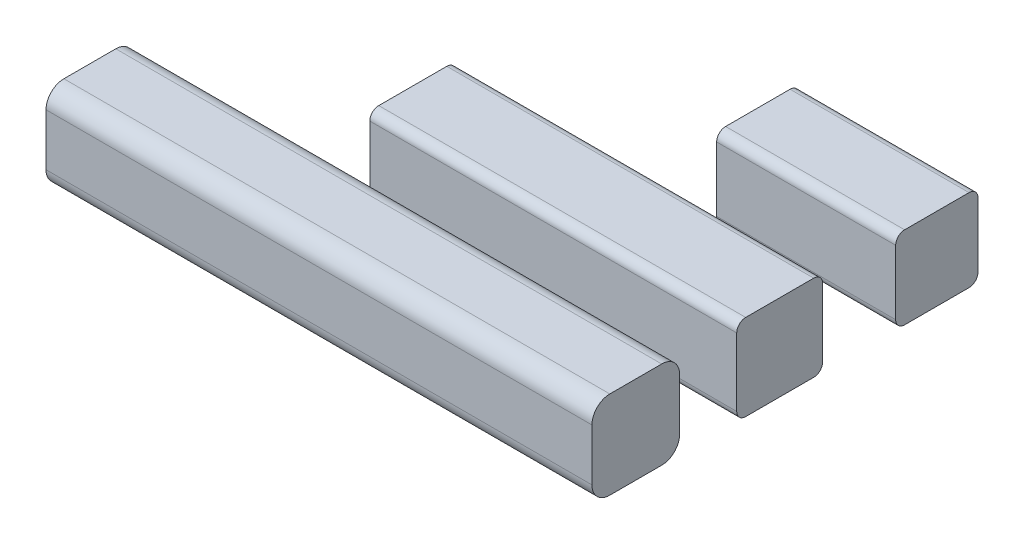
ISO-10303-21;
HEADER;
FILE_DESCRIPTION(('STEP AP214'),'2;1');
FILE_NAME('part.step','',(''),(''),'','','');
FILE_SCHEMA(('AUTOMOTIVE_DESIGN { 1 0 10303 214 1 1 1 1 }'));
ENDSEC;
DATA;
#1=APPLICATION_CONTEXT('core data for automotive mechanical design processes');
#2=APPLICATION_PROTOCOL_DEFINITION('international standard','automotive_design',2000,#1);
#3=PRODUCT_CONTEXT('',#1,'mechanical');
#4=PRODUCT('Part','Part','',(#3));
#5=PRODUCT_RELATED_PRODUCT_CATEGORY('part','',(#4));
#6=PRODUCT_DEFINITION_FORMATION('','',#4);
#7=PRODUCT_DEFINITION_CONTEXT('part definition',#1,'design');
#8=PRODUCT_DEFINITION('design','',#6,#7);
#9=PRODUCT_DEFINITION_SHAPE('','',#8);
#10=(LENGTH_UNIT() NAMED_UNIT(*) SI_UNIT(.MILLI.,.METRE.));
#11=(NAMED_UNIT(*) PLANE_ANGLE_UNIT() SI_UNIT($,.RADIAN.));
#12=(NAMED_UNIT(*) SI_UNIT($,.STERADIAN.) SOLID_ANGLE_UNIT());
#13=UNCERTAINTY_MEASURE_WITH_UNIT(LENGTH_MEASURE(1.E-05),#10,'distance_accuracy_value','');
#14=(GEOMETRIC_REPRESENTATION_CONTEXT(3) GLOBAL_UNCERTAINTY_ASSIGNED_CONTEXT((#13)) GLOBAL_UNIT_ASSIGNED_CONTEXT((#10,
#11,#12)) REPRESENTATION_CONTEXT('',''));
#15=CARTESIAN_POINT('',(0.,0.,0.));
#16=DIRECTION('',(0.,0.,1.));
#17=DIRECTION('',(1.,0.,0.));
#18=AXIS2_PLACEMENT_3D('',#15,#16,#17);
#19=CARTESIAN_POINT('',(10.,0.,-32.7247889230842));
#20=DIRECTION('',(0.,0.,-1.));
#21=DIRECTION('',(-1.,0.,0.));
#22=AXIS2_PLACEMENT_3D('',#19,#20,#21);
#23=PLANE('',#22);
#24=DIRECTION('',(-1.,0.,0.));
#25=VECTOR('',#24,1.);
#26=CARTESIAN_POINT('',(10.,4.3,-32.7247889230842));
#27=LINE('',#26,#25);
#28=CARTESIAN_POINT('',(10.,4.3,-32.7247889230842));
#29=VERTEX_POINT('',#28);
#30=CARTESIAN_POINT('',(-10.5,4.3,-32.7247889230842));
#31=VERTEX_POINT('',#30);
#32=EDGE_CURVE('E54',#29,#31,#27,.T.);
#33=ORIENTED_EDGE('',*,*,#32,.T.);
#34=DIRECTION('',(0.,1.,0.));
#35=VECTOR('',#34,1.);
#36=CARTESIAN_POINT('',(-10.5,0.5,-32.7247889230842));
#37=LINE('',#36,#35);
#38=CARTESIAN_POINT('',(-10.5,0.5,-32.7247889230842));
#39=VERTEX_POINT('',#38);
#40=EDGE_CURVE('E136',#39,#31,#37,.T.);
#41=ORIENTED_EDGE('',*,*,#40,.F.);
#42=DIRECTION('',(-1.,0.,0.));
#43=VECTOR('',#42,1.);
#44=CARTESIAN_POINT('',(10.,0.5,-32.7247889230842));
#45=LINE('',#44,#43);
#46=CARTESIAN_POINT('',(10.,0.5,-32.7247889230842));
#47=VERTEX_POINT('',#46);
#48=EDGE_CURVE('E12',#39,#47,#45,.F.);
#49=ORIENTED_EDGE('',*,*,#48,.T.);
#50=DIRECTION('',(0.,-1.,0.));
#51=VECTOR('',#50,1.);
#52=CARTESIAN_POINT('',(10.,0.,-32.7247889230842));
#53=LINE('',#52,#51);
#54=EDGE_CURVE('E152',#29,#47,#53,.T.);
#55=ORIENTED_EDGE('',*,*,#54,.F.);
#56=EDGE_LOOP('',(#33,#41,#49,#55));
#57=FACE_BOUND('',#56,.T.);
#58=ADVANCED_FACE('F46',(#57),#23,.F.);
#59=CARTESIAN_POINT('',(10.,0.,-32.7247889230842));
#60=DIRECTION('',(0.,1.,0.));
#61=DIRECTION('',(0.,0.,1.));
#62=AXIS2_PLACEMENT_3D('',#59,#60,#61);
#63=PLANE('',#62);
#64=DIRECTION('',(-1.,0.,0.));
#65=VECTOR('',#64,1.);
#66=CARTESIAN_POINT('',(10.,0.,-33.2247889230842));
#67=LINE('',#66,#65);
#68=CARTESIAN_POINT('',(10.,0.,-33.2247889230842));
#69=VERTEX_POINT('',#68);
#70=CARTESIAN_POINT('',(-10.5,0.,-33.2247889230842));
#71=VERTEX_POINT('',#70);
#72=EDGE_CURVE('E171',#69,#71,#67,.T.);
#73=ORIENTED_EDGE('',*,*,#72,.T.);
#74=DIRECTION('',(0.,0.,1.));
#75=VECTOR('',#74,1.);
#76=CARTESIAN_POINT('',(-10.5,0.,-37.0247889230842));
#77=LINE('',#76,#75);
#78=CARTESIAN_POINT('',(-10.5,0.,-37.0247889230842));
#79=VERTEX_POINT('',#78);
#80=EDGE_CURVE('E146',#79,#71,#77,.T.);
#81=ORIENTED_EDGE('',*,*,#80,.F.);
#82=DIRECTION('',(-1.,0.,0.));
#83=VECTOR('',#82,1.);
#84=CARTESIAN_POINT('',(10.,0.,-37.0247889230842));
#85=LINE('',#84,#83);
#86=CARTESIAN_POINT('',(10.,0.,-37.0247889230842));
#87=VERTEX_POINT('',#86);
#88=EDGE_CURVE('E61',#79,#87,#85,.F.);
#89=ORIENTED_EDGE('',*,*,#88,.T.);
#90=DIRECTION('',(0.,0.,-1.));
#91=VECTOR('',#90,1.);
#92=CARTESIAN_POINT('',(10.,0.,-32.7247889230842));
#93=LINE('',#92,#91);
#94=EDGE_CURVE('E154',#69,#87,#93,.T.);
#95=ORIENTED_EDGE('',*,*,#94,.F.);
#96=EDGE_LOOP('',(#73,#81,#89,#95));
#97=FACE_BOUND('',#96,.T.);
#98=ADVANCED_FACE('F180',(#97),#63,.F.);
#99=CARTESIAN_POINT('',(10.,0.,-37.5247889230842));
#100=DIRECTION('',(0.,0.,1.));
#101=DIRECTION('',(1.,0.,0.));
#102=AXIS2_PLACEMENT_3D('',#99,#100,#101);
#103=PLANE('',#102);
#104=DIRECTION('',(-1.,0.,0.));
#105=VECTOR('',#104,1.);
#106=CARTESIAN_POINT('',(10.,0.5,-37.5247889230842));
#107=LINE('',#106,#105);
#108=CARTESIAN_POINT('',(10.,0.5,-37.5247889230842));
#109=VERTEX_POINT('',#108);
#110=CARTESIAN_POINT('',(-10.5,0.5,-37.5247889230842));
#111=VERTEX_POINT('',#110);
#112=EDGE_CURVE('E161',#109,#111,#107,.T.);
#113=ORIENTED_EDGE('',*,*,#112,.T.);
#114=DIRECTION('',(0.,-1.,0.));
#115=VECTOR('',#114,1.);
#116=CARTESIAN_POINT('',(-10.5,4.3,-37.5247889230842));
#117=LINE('',#116,#115);
#118=CARTESIAN_POINT('',(-10.5,4.3,-37.5247889230842));
#119=VERTEX_POINT('',#118);
#120=EDGE_CURVE('E140',#119,#111,#117,.T.);
#121=ORIENTED_EDGE('',*,*,#120,.F.);
#122=DIRECTION('',(-1.,0.,0.));
#123=VECTOR('',#122,1.);
#124=CARTESIAN_POINT('',(10.,4.3,-37.5247889230842));
#125=LINE('',#124,#123);
#126=CARTESIAN_POINT('',(10.,4.3,-37.5247889230842));
#127=VERTEX_POINT('',#126);
#128=EDGE_CURVE('E163',#119,#127,#125,.F.);
#129=ORIENTED_EDGE('',*,*,#128,.T.);
#130=DIRECTION('',(0.,1.,0.));
#131=VECTOR('',#130,1.);
#132=CARTESIAN_POINT('',(10.,0.,-37.5247889230842));
#133=LINE('',#132,#131);
#134=EDGE_CURVE('E156',#109,#127,#133,.T.);
#135=ORIENTED_EDGE('',*,*,#134,.F.);
#136=EDGE_LOOP('',(#113,#121,#129,#135));
#137=FACE_BOUND('',#136,.T.);
#138=ADVANCED_FACE('F190',(#137),#103,.F.);
#139=CARTESIAN_POINT('',(10.,4.8,-32.7247889230842));
#140=DIRECTION('',(0.,-1.,0.));
#141=DIRECTION('',(0.,0.,-1.));
#142=AXIS2_PLACEMENT_3D('',#139,#140,#141);
#143=PLANE('',#142);
#144=DIRECTION('',(0.,0.,1.));
#145=VECTOR('',#144,1.);
#146=CARTESIAN_POINT('',(10.,4.8,-32.7247889230842));
#147=LINE('',#146,#145);
#148=CARTESIAN_POINT('',(10.,4.8,-37.0247889230842));
#149=VERTEX_POINT('',#148);
#150=CARTESIAN_POINT('',(10.,4.8,-33.2247889230842));
#151=VERTEX_POINT('',#150);
#152=EDGE_CURVE('E121',#149,#151,#147,.T.);
#153=ORIENTED_EDGE('',*,*,#152,.F.);
#154=DIRECTION('',(-1.,0.,0.));
#155=VECTOR('',#154,1.);
#156=CARTESIAN_POINT('',(10.,4.8,-37.0247889230842));
#157=LINE('',#156,#155);
#158=CARTESIAN_POINT('',(-10.5,4.8,-37.0247889230842));
#159=VERTEX_POINT('',#158);
#160=EDGE_CURVE('E120',#149,#159,#157,.T.);
#161=ORIENTED_EDGE('',*,*,#160,.T.);
#162=DIRECTION('',(0.,0.,-1.));
#163=VECTOR('',#162,1.);
#164=CARTESIAN_POINT('',(-10.5,4.8,-33.2247889230842));
#165=LINE('',#164,#163);
#166=CARTESIAN_POINT('',(-10.5,4.8,-33.2247889230842));
#167=VERTEX_POINT('',#166);
#168=EDGE_CURVE('E124',#167,#159,#165,.T.);
#169=ORIENTED_EDGE('',*,*,#168,.F.);
#170=DIRECTION('',(-1.,0.,0.));
#171=VECTOR('',#170,1.);
#172=CARTESIAN_POINT('',(10.,4.8,-33.2247889230842));
#173=LINE('',#172,#171);
#174=EDGE_CURVE('E111',#167,#151,#173,.F.);
#175=ORIENTED_EDGE('',*,*,#174,.T.);
#176=EDGE_LOOP('',(#153,#161,#169,#175));
#177=FACE_BOUND('',#176,.T.);
#178=ADVANCED_FACE('F125',(#177),#143,.F.);
#179=CARTESIAN_POINT('',(10.,0.,0.));
#180=DIRECTION('',(-1.,0.,0.));
#181=DIRECTION('',(0.,0.,1.));
#182=AXIS2_PLACEMENT_3D('',#179,#180,#181);
#183=PLANE('',#182);
#184=ORIENTED_EDGE('',*,*,#134,.T.);
#185=CARTESIAN_POINT('',(10.,4.3,-37.0247889230842));
#186=DIRECTION('',(-1.,0.,0.));
#187=DIRECTION('',(0.,0.,1.));
#188=AXIS2_PLACEMENT_3D('',#185,#186,#187);
#189=CIRCLE('',#188,0.5);
#190=EDGE_CURVE('E169',#127,#149,#189,.F.);
#191=ORIENTED_EDGE('',*,*,#190,.T.);
#192=ORIENTED_EDGE('',*,*,#152,.T.);
#193=CARTESIAN_POINT('',(10.,4.3,-33.2247889230842));
#194=DIRECTION('',(-1.,0.,0.));
#195=DIRECTION('',(0.,0.,1.));
#196=AXIS2_PLACEMENT_3D('',#193,#194,#195);
#197=CIRCLE('',#196,0.5);
#198=EDGE_CURVE('E116',#151,#29,#197,.F.);
#199=ORIENTED_EDGE('',*,*,#198,.T.);
#200=ORIENTED_EDGE('',*,*,#54,.T.);
#201=CARTESIAN_POINT('',(10.,0.5,-33.2247889230842));
#202=DIRECTION('',(-1.,0.,0.));
#203=DIRECTION('',(0.,0.,1.));
#204=AXIS2_PLACEMENT_3D('',#201,#202,#203);
#205=CIRCLE('',#204,0.5);
#206=EDGE_CURVE('E68',#47,#69,#205,.F.);
#207=ORIENTED_EDGE('',*,*,#206,.T.);
#208=ORIENTED_EDGE('',*,*,#94,.T.);
#209=CARTESIAN_POINT('',(10.,0.5,-37.0247889230842));
#210=DIRECTION('',(-1.,0.,0.));
#211=DIRECTION('',(0.,0.,1.));
#212=AXIS2_PLACEMENT_3D('',#209,#210,#211);
#213=CIRCLE('',#212,0.5);
#214=EDGE_CURVE('E167',#87,#109,#213,.F.);
#215=ORIENTED_EDGE('',*,*,#214,.T.);
#216=EDGE_LOOP('',(#184,#191,#192,#199,#200,#207,#208,#215));
#217=FACE_BOUND('',#216,.T.);
#218=ADVANCED_FACE('F175',(#217),#183,.F.);
#219=CARTESIAN_POINT('',(10.,4.3,-37.0247889230842));
#220=DIRECTION('',(-1.,0.,0.));
#221=DIRECTION('',(0.,0.,1.));
#222=AXIS2_PLACEMENT_3D('',#219,#220,#221);
#223=CYLINDRICAL_SURFACE('',#222,0.5);
#224=ORIENTED_EDGE('',*,*,#190,.F.);
#225=ORIENTED_EDGE('',*,*,#128,.F.);
#226=CARTESIAN_POINT('',(-10.5,4.3,-37.0247889230842));
#227=DIRECTION('',(-1.,0.,0.));
#228=DIRECTION('',(0.,0.,1.));
#229=AXIS2_PLACEMENT_3D('',#226,#227,#228);
#230=CIRCLE('',#229,0.5);
#231=EDGE_CURVE('E130',#159,#119,#230,.T.);
#232=ORIENTED_EDGE('',*,*,#231,.F.);
#233=ORIENTED_EDGE('',*,*,#160,.F.);
#234=EDGE_LOOP('',(#224,#225,#232,#233));
#235=FACE_BOUND('',#234,.T.);
#236=ADVANCED_FACE('F192',(#235),#223,.T.);
#237=CARTESIAN_POINT('',(10.,0.5,-37.0247889230842));
#238=DIRECTION('',(-1.,0.,0.));
#239=DIRECTION('',(0.,0.,1.));
#240=AXIS2_PLACEMENT_3D('',#237,#238,#239);
#241=CYLINDRICAL_SURFACE('',#240,0.5);
#242=ORIENTED_EDGE('',*,*,#214,.F.);
#243=ORIENTED_EDGE('',*,*,#88,.F.);
#244=CARTESIAN_POINT('',(-10.5,0.5,-37.0247889230842));
#245=DIRECTION('',(-1.,0.,0.));
#246=DIRECTION('',(0.,0.,1.));
#247=AXIS2_PLACEMENT_3D('',#244,#245,#246);
#248=CIRCLE('',#247,0.5);
#249=EDGE_CURVE('E143',#111,#79,#248,.T.);
#250=ORIENTED_EDGE('',*,*,#249,.F.);
#251=ORIENTED_EDGE('',*,*,#112,.F.);
#252=EDGE_LOOP('',(#242,#243,#250,#251));
#253=FACE_BOUND('',#252,.T.);
#254=ADVANCED_FACE('F186',(#253),#241,.T.);
#255=CARTESIAN_POINT('',(10.,0.5,-33.2247889230842));
#256=DIRECTION('',(-1.,0.,0.));
#257=DIRECTION('',(0.,0.,1.));
#258=AXIS2_PLACEMENT_3D('',#255,#256,#257);
#259=CYLINDRICAL_SURFACE('',#258,0.5);
#260=ORIENTED_EDGE('',*,*,#206,.F.);
#261=ORIENTED_EDGE('',*,*,#48,.F.);
#262=CARTESIAN_POINT('',(-10.5,0.5,-33.2247889230842));
#263=DIRECTION('',(-1.,0.,0.));
#264=DIRECTION('',(0.,0.,1.));
#265=AXIS2_PLACEMENT_3D('',#262,#263,#264);
#266=CIRCLE('',#265,0.5);
#267=EDGE_CURVE('E149',#71,#39,#266,.T.);
#268=ORIENTED_EDGE('',*,*,#267,.F.);
#269=ORIENTED_EDGE('',*,*,#72,.F.);
#270=EDGE_LOOP('',(#260,#261,#268,#269));
#271=FACE_BOUND('',#270,.T.);
#272=ADVANCED_FACE('F178',(#271),#259,.T.);
#273=CARTESIAN_POINT('',(10.,4.3,-33.2247889230842));
#274=DIRECTION('',(-1.,0.,0.));
#275=DIRECTION('',(0.,0.,1.));
#276=AXIS2_PLACEMENT_3D('',#273,#274,#275);
#277=CYLINDRICAL_SURFACE('',#276,0.5);
#278=ORIENTED_EDGE('',*,*,#198,.F.);
#279=ORIENTED_EDGE('',*,*,#174,.F.);
#280=CARTESIAN_POINT('',(-10.5,4.3,-33.2247889230842));
#281=DIRECTION('',(-1.,0.,0.));
#282=DIRECTION('',(0.,0.,1.));
#283=AXIS2_PLACEMENT_3D('',#280,#281,#282);
#284=CIRCLE('',#283,0.5);
#285=EDGE_CURVE('E115',#31,#167,#284,.T.);
#286=ORIENTED_EDGE('',*,*,#285,.F.);
#287=ORIENTED_EDGE('',*,*,#32,.F.);
#288=EDGE_LOOP('',(#278,#279,#286,#287));
#289=FACE_BOUND('',#288,.T.);
#290=ADVANCED_FACE('F48',(#289),#277,.T.);
#291=CARTESIAN_POINT('',(-10.5,4.3,-33.2247889230842));
#292=DIRECTION('',(-1.,0.,0.));
#293=DIRECTION('',(0.,0.,1.));
#294=AXIS2_PLACEMENT_3D('',#291,#292,#293);
#295=PLANE('',#294);
#296=ORIENTED_EDGE('',*,*,#285,.T.);
#297=ORIENTED_EDGE('',*,*,#168,.T.);
#298=ORIENTED_EDGE('',*,*,#231,.T.);
#299=ORIENTED_EDGE('',*,*,#120,.T.);
#300=ORIENTED_EDGE('',*,*,#249,.T.);
#301=ORIENTED_EDGE('',*,*,#80,.T.);
#302=ORIENTED_EDGE('',*,*,#267,.T.);
#303=ORIENTED_EDGE('',*,*,#40,.T.);
#304=EDGE_LOOP('',(#296,#297,#298,#299,#300,#301,#302,#303));
#305=FACE_BOUND('',#304,.T.);
#306=ADVANCED_FACE('F133',(#305),#295,.T.);
#307=CLOSED_SHELL('',(#58,#98,#138,#178,#218,#236,#254,#272,#290,#306));
#308=MANIFOLD_SOLID_BREP('B2',#307);
#309=CARTESIAN_POINT('',(10.,0.,-41.6043834030538));
#310=DIRECTION('',(0.,0.,-1.));
#311=DIRECTION('',(-1.,0.,0.));
#312=AXIS2_PLACEMENT_3D('',#309,#310,#311);
#313=PLANE('',#312);
#314=DIRECTION('',(0.,-1.,0.));
#315=VECTOR('',#314,1.);
#316=CARTESIAN_POINT('',(0.,0.,-41.6043834030538));
#317=LINE('',#316,#315);
#318=CARTESIAN_POINT('',(0.,4.1,-41.6043834030538));
#319=VERTEX_POINT('',#318);
#320=CARTESIAN_POINT('',(0.,0.5,-41.6043834030538));
#321=VERTEX_POINT('',#320);
#322=EDGE_CURVE('E398',#319,#321,#317,.T.);
#323=ORIENTED_EDGE('',*,*,#322,.T.);
#324=DIRECTION('',(-1.,0.,0.));
#325=VECTOR('',#324,1.);
#326=CARTESIAN_POINT('',(10.,0.5,-41.6043834030538));
#327=LINE('',#326,#325);
#328=CARTESIAN_POINT('',(10.,0.5,-41.6043834030538));
#329=VERTEX_POINT('',#328);
#330=EDGE_CURVE('E376',#321,#329,#327,.F.);
#331=ORIENTED_EDGE('',*,*,#330,.T.);
#332=DIRECTION('',(0.,-1.,0.));
#333=VECTOR('',#332,1.);
#334=CARTESIAN_POINT('',(10.,0.,-41.6043834030538));
#335=LINE('',#334,#333);
#336=CARTESIAN_POINT('',(10.,4.1,-41.6043834030538));
#337=VERTEX_POINT('',#336);
#338=EDGE_CURVE('E407',#337,#329,#335,.T.);
#339=ORIENTED_EDGE('',*,*,#338,.F.);
#340=DIRECTION('',(-1.,0.,0.));
#341=VECTOR('',#340,1.);
#342=CARTESIAN_POINT('',(10.,4.1,-41.6043834030538));
#343=LINE('',#342,#341);
#344=EDGE_CURVE('E381',#337,#319,#343,.T.);
#345=ORIENTED_EDGE('',*,*,#344,.T.);
#346=EDGE_LOOP('',(#323,#331,#339,#345));
#347=FACE_BOUND('',#346,.T.);
#348=ADVANCED_FACE('F306',(#347),#313,.F.);
#349=CARTESIAN_POINT('',(10.,0.,-41.6043834030538));
#350=DIRECTION('',(0.,1.,0.));
#351=DIRECTION('',(0.,0.,1.));
#352=AXIS2_PLACEMENT_3D('',#349,#350,#351);
#353=PLANE('',#352);
#354=DIRECTION('',(0.,0.,-1.));
#355=VECTOR('',#354,1.);
#356=CARTESIAN_POINT('',(10.,0.,-41.6043834030538));
#357=LINE('',#356,#355);
#358=CARTESIAN_POINT('',(10.,0.,-42.1043834030538));
#359=VERTEX_POINT('',#358);
#360=CARTESIAN_POINT('',(10.,0.,-45.7043834030538));
#361=VERTEX_POINT('',#360);
#362=EDGE_CURVE('E391',#359,#361,#357,.T.);
#363=ORIENTED_EDGE('',*,*,#362,.F.);
#364=DIRECTION('',(-1.,0.,0.));
#365=VECTOR('',#364,1.);
#366=CARTESIAN_POINT('',(10.,0.,-42.1043834030538));
#367=LINE('',#366,#365);
#368=CARTESIAN_POINT('',(0.,0.,-42.1043834030538));
#369=VERTEX_POINT('',#368);
#370=EDGE_CURVE('E375',#359,#369,#367,.T.);
#371=ORIENTED_EDGE('',*,*,#370,.T.);
#372=DIRECTION('',(0.,0.,-1.));
#373=VECTOR('',#372,1.);
#374=CARTESIAN_POINT('',(0.,0.,-41.6043834030538));
#375=LINE('',#374,#373);
#376=CARTESIAN_POINT('',(0.,0.,-45.7043834030538));
#377=VERTEX_POINT('',#376);
#378=EDGE_CURVE('E388',#369,#377,#375,.T.);
#379=ORIENTED_EDGE('',*,*,#378,.T.);
#380=DIRECTION('',(-1.,0.,0.));
#381=VECTOR('',#380,1.);
#382=CARTESIAN_POINT('',(10.,0.,-45.7043834030538));
#383=LINE('',#382,#381);
#384=EDGE_CURVE('E393',#377,#361,#383,.F.);
#385=ORIENTED_EDGE('',*,*,#384,.T.);
#386=EDGE_LOOP('',(#363,#371,#379,#385));
#387=FACE_BOUND('',#386,.T.);
#388=ADVANCED_FACE('F387',(#387),#353,.F.);
#389=CARTESIAN_POINT('',(10.,0.,-46.2043834030538));
#390=DIRECTION('',(0.,0.,1.));
#391=DIRECTION('',(1.,0.,0.));
#392=AXIS2_PLACEMENT_3D('',#389,#390,#391);
#393=PLANE('',#392);
#394=DIRECTION('',(0.,1.,0.));
#395=VECTOR('',#394,1.);
#396=CARTESIAN_POINT('',(10.,0.,-46.2043834030538));
#397=LINE('',#396,#395);
#398=CARTESIAN_POINT('',(10.,0.5,-46.2043834030538));
#399=VERTEX_POINT('',#398);
#400=CARTESIAN_POINT('',(10.,4.1,-46.2043834030538));
#401=VERTEX_POINT('',#400);
#402=EDGE_CURVE('E441',#399,#401,#397,.T.);
#403=ORIENTED_EDGE('',*,*,#402,.F.);
#404=DIRECTION('',(-1.,0.,0.));
#405=VECTOR('',#404,1.);
#406=CARTESIAN_POINT('',(10.,0.5,-46.2043834030538));
#407=LINE('',#406,#405);
#408=CARTESIAN_POINT('',(0.,0.5,-46.2043834030538));
#409=VERTEX_POINT('',#408);
#410=EDGE_CURVE('E426',#399,#409,#407,.T.);
#411=ORIENTED_EDGE('',*,*,#410,.T.);
#412=DIRECTION('',(0.,1.,0.));
#413=VECTOR('',#412,1.);
#414=CARTESIAN_POINT('',(0.,0.,-46.2043834030538));
#415=LINE('',#414,#413);
#416=CARTESIAN_POINT('',(0.,4.1,-46.2043834030538));
#417=VERTEX_POINT('',#416);
#418=EDGE_CURVE('E397',#409,#417,#415,.T.);
#419=ORIENTED_EDGE('',*,*,#418,.T.);
#420=DIRECTION('',(-1.,0.,0.));
#421=VECTOR('',#420,1.);
#422=CARTESIAN_POINT('',(10.,4.1,-46.2043834030538));
#423=LINE('',#422,#421);
#424=EDGE_CURVE('E424',#417,#401,#423,.F.);
#425=ORIENTED_EDGE('',*,*,#424,.T.);
#426=EDGE_LOOP('',(#403,#411,#419,#425));
#427=FACE_BOUND('',#426,.T.);
#428=ADVANCED_FACE('F452',(#427),#393,.F.);
#429=CARTESIAN_POINT('',(10.,4.6,-41.6043834030538));
#430=DIRECTION('',(0.,-1.,0.));
#431=DIRECTION('',(0.,0.,-1.));
#432=AXIS2_PLACEMENT_3D('',#429,#430,#431);
#433=PLANE('',#432);
#434=DIRECTION('',(0.,0.,1.));
#435=VECTOR('',#434,1.);
#436=CARTESIAN_POINT('',(0.,4.6,-41.6043834030538));
#437=LINE('',#436,#435);
#438=CARTESIAN_POINT('',(0.,4.6,-45.7043834030538));
#439=VERTEX_POINT('',#438);
#440=CARTESIAN_POINT('',(0.,4.6,-42.1043834030538));
#441=VERTEX_POINT('',#440);
#442=EDGE_CURVE('E401',#439,#441,#437,.T.);
#443=ORIENTED_EDGE('',*,*,#442,.T.);
#444=DIRECTION('',(-1.,0.,0.));
#445=VECTOR('',#444,1.);
#446=CARTESIAN_POINT('',(10.,4.6,-42.1043834030538));
#447=LINE('',#446,#445);
#448=CARTESIAN_POINT('',(10.,4.6,-42.1043834030538));
#449=VERTEX_POINT('',#448);
#450=EDGE_CURVE('E44',#441,#449,#447,.F.);
#451=ORIENTED_EDGE('',*,*,#450,.T.);
#452=DIRECTION('',(0.,0.,1.));
#453=VECTOR('',#452,1.);
#454=CARTESIAN_POINT('',(10.,4.6,-41.6043834030538));
#455=LINE('',#454,#453);
#456=CARTESIAN_POINT('',(10.,4.6,-45.7043834030538));
#457=VERTEX_POINT('',#456);
#458=EDGE_CURVE('E408',#457,#449,#455,.T.);
#459=ORIENTED_EDGE('',*,*,#458,.F.);
#460=DIRECTION('',(-1.,0.,0.));
#461=VECTOR('',#460,1.);
#462=CARTESIAN_POINT('',(10.,4.6,-45.7043834030538));
#463=LINE('',#462,#461);
#464=EDGE_CURVE('E314',#457,#439,#463,.T.);
#465=ORIENTED_EDGE('',*,*,#464,.T.);
#466=EDGE_LOOP('',(#443,#451,#459,#465));
#467=FACE_BOUND('',#466,.T.);
#468=ADVANCED_FACE('F431',(#467),#433,.F.);
#469=CARTESIAN_POINT('',(10.,0.,0.));
#470=DIRECTION('',(-1.,0.,0.));
#471=DIRECTION('',(0.,0.,1.));
#472=AXIS2_PLACEMENT_3D('',#469,#470,#471);
#473=PLANE('',#472);
#474=ORIENTED_EDGE('',*,*,#338,.T.);
#475=CARTESIAN_POINT('',(10.,0.5,-42.1043834030538));
#476=DIRECTION('',(-1.,0.,0.));
#477=DIRECTION('',(0.,0.,1.));
#478=AXIS2_PLACEMENT_3D('',#475,#476,#477);
#479=CIRCLE('',#478,0.5);
#480=EDGE_CURVE('E422',#329,#359,#479,.F.);
#481=ORIENTED_EDGE('',*,*,#480,.T.);
#482=ORIENTED_EDGE('',*,*,#362,.T.);
#483=CARTESIAN_POINT('',(10.,0.5,-45.7043834030538));
#484=DIRECTION('',(-1.,0.,0.));
#485=DIRECTION('',(0.,0.,1.));
#486=AXIS2_PLACEMENT_3D('',#483,#484,#485);
#487=CIRCLE('',#486,0.5);
#488=EDGE_CURVE('E420',#361,#399,#487,.F.);
#489=ORIENTED_EDGE('',*,*,#488,.T.);
#490=ORIENTED_EDGE('',*,*,#402,.T.);
#491=CARTESIAN_POINT('',(10.,4.1,-45.7043834030538));
#492=DIRECTION('',(-1.,0.,0.));
#493=DIRECTION('',(0.,0.,1.));
#494=AXIS2_PLACEMENT_3D('',#491,#492,#493);
#495=CIRCLE('',#494,0.5);
#496=EDGE_CURVE('E326',#401,#457,#495,.F.);
#497=ORIENTED_EDGE('',*,*,#496,.T.);
#498=ORIENTED_EDGE('',*,*,#458,.T.);
#499=CARTESIAN_POINT('',(10.,4.1,-42.1043834030538));
#500=DIRECTION('',(-1.,0.,0.));
#501=DIRECTION('',(0.,0.,1.));
#502=AXIS2_PLACEMENT_3D('',#499,#500,#501);
#503=CIRCLE('',#502,0.5);
#504=EDGE_CURVE('E418',#449,#337,#503,.F.);
#505=ORIENTED_EDGE('',*,*,#504,.T.);
#506=EDGE_LOOP('',(#474,#481,#482,#489,#490,#497,#498,#505));
#507=FACE_BOUND('',#506,.T.);
#508=ADVANCED_FACE('F444',(#507),#473,.F.);
#509=CARTESIAN_POINT('',(0.,0.,0.));
#510=DIRECTION('',(-1.,0.,0.));
#511=DIRECTION('',(0.,0.,1.));
#512=AXIS2_PLACEMENT_3D('',#509,#510,#511);
#513=PLANE('',#512);
#514=ORIENTED_EDGE('',*,*,#378,.F.);
#515=CARTESIAN_POINT('',(0.,0.5,-42.1043834030538));
#516=DIRECTION('',(-1.,0.,0.));
#517=DIRECTION('',(0.,0.,1.));
#518=AXIS2_PLACEMENT_3D('',#515,#516,#517);
#519=CIRCLE('',#518,0.5);
#520=EDGE_CURVE('E371',#369,#321,#519,.T.);
#521=ORIENTED_EDGE('',*,*,#520,.T.);
#522=ORIENTED_EDGE('',*,*,#322,.F.);
#523=CARTESIAN_POINT('',(0.,4.1,-42.1043834030538));
#524=DIRECTION('',(-1.,0.,0.));
#525=DIRECTION('',(0.,0.,1.));
#526=AXIS2_PLACEMENT_3D('',#523,#524,#525);
#527=CIRCLE('',#526,0.5);
#528=EDGE_CURVE('E411',#319,#441,#527,.T.);
#529=ORIENTED_EDGE('',*,*,#528,.T.);
#530=ORIENTED_EDGE('',*,*,#442,.F.);
#531=CARTESIAN_POINT('',(0.,4.1,-45.7043834030538));
#532=DIRECTION('',(-1.,0.,0.));
#533=DIRECTION('',(0.,0.,1.));
#534=AXIS2_PLACEMENT_3D('',#531,#532,#533);
#535=CIRCLE('',#534,0.5);
#536=EDGE_CURVE('E392',#439,#417,#535,.T.);
#537=ORIENTED_EDGE('',*,*,#536,.T.);
#538=ORIENTED_EDGE('',*,*,#418,.F.);
#539=CARTESIAN_POINT('',(0.,0.5,-45.7043834030538));
#540=DIRECTION('',(-1.,0.,0.));
#541=DIRECTION('',(0.,0.,1.));
#542=AXIS2_PLACEMENT_3D('',#539,#540,#541);
#543=CIRCLE('',#542,0.5);
#544=EDGE_CURVE('E382',#409,#377,#543,.T.);
#545=ORIENTED_EDGE('',*,*,#544,.T.);
#546=EDGE_LOOP('',(#514,#521,#522,#529,#530,#537,#538,#545));
#547=FACE_BOUND('',#546,.T.);
#548=ADVANCED_FACE('F395',(#547),#513,.T.);
#549=CARTESIAN_POINT('',(10.,0.5,-42.1043834030538));
#550=DIRECTION('',(-1.,0.,0.));
#551=DIRECTION('',(0.,0.,1.));
#552=AXIS2_PLACEMENT_3D('',#549,#550,#551);
#553=CYLINDRICAL_SURFACE('',#552,0.5);
#554=ORIENTED_EDGE('',*,*,#480,.F.);
#555=ORIENTED_EDGE('',*,*,#330,.F.);
#556=ORIENTED_EDGE('',*,*,#520,.F.);
#557=ORIENTED_EDGE('',*,*,#370,.F.);
#558=EDGE_LOOP('',(#554,#555,#556,#557));
#559=FACE_BOUND('',#558,.T.);
#560=ADVANCED_FACE('F374',(#559),#553,.T.);
#561=CARTESIAN_POINT('',(10.,0.5,-45.7043834030538));
#562=DIRECTION('',(-1.,0.,0.));
#563=DIRECTION('',(0.,0.,1.));
#564=AXIS2_PLACEMENT_3D('',#561,#562,#563);
#565=CYLINDRICAL_SURFACE('',#564,0.5);
#566=ORIENTED_EDGE('',*,*,#488,.F.);
#567=ORIENTED_EDGE('',*,*,#384,.F.);
#568=ORIENTED_EDGE('',*,*,#544,.F.);
#569=ORIENTED_EDGE('',*,*,#410,.F.);
#570=EDGE_LOOP('',(#566,#567,#568,#569));
#571=FACE_BOUND('',#570,.T.);
#572=ADVANCED_FACE('F464',(#571),#565,.T.);
#573=CARTESIAN_POINT('',(10.,4.1,-42.1043834030538));
#574=DIRECTION('',(-1.,0.,0.));
#575=DIRECTION('',(0.,0.,1.));
#576=AXIS2_PLACEMENT_3D('',#573,#574,#575);
#577=CYLINDRICAL_SURFACE('',#576,0.5);
#578=ORIENTED_EDGE('',*,*,#504,.F.);
#579=ORIENTED_EDGE('',*,*,#450,.F.);
#580=ORIENTED_EDGE('',*,*,#528,.F.);
#581=ORIENTED_EDGE('',*,*,#344,.F.);
#582=EDGE_LOOP('',(#578,#579,#580,#581));
#583=FACE_BOUND('',#582,.T.);
#584=ADVANCED_FACE('F436',(#583),#577,.T.);
#585=CARTESIAN_POINT('',(10.,4.1,-45.7043834030538));
#586=DIRECTION('',(-1.,0.,0.));
#587=DIRECTION('',(0.,0.,1.));
#588=AXIS2_PLACEMENT_3D('',#585,#586,#587);
#589=CYLINDRICAL_SURFACE('',#588,0.5);
#590=ORIENTED_EDGE('',*,*,#496,.F.);
#591=ORIENTED_EDGE('',*,*,#424,.F.);
#592=ORIENTED_EDGE('',*,*,#536,.F.);
#593=ORIENTED_EDGE('',*,*,#464,.F.);
#594=EDGE_LOOP('',(#590,#591,#592,#593));
#595=FACE_BOUND('',#594,.T.);
#596=ADVANCED_FACE('F308',(#595),#589,.T.);
#597=CLOSED_SHELL('',(#348,#388,#428,#468,#508,#548,#560,#572,#584,#596));
#598=MANIFOLD_SOLID_BREP('B6',#597);
#599=CARTESIAN_POINT('',(-20.4935207295298,5.,-29.5269272945028));
#600=DIRECTION('',(1.,0.,0.));
#601=DIRECTION('',(0.,0.,-1.));
#602=AXIS2_PLACEMENT_3D('',#599,#600,#601);
#603=PLANE('',#602);
#604=DIRECTION('',(0.,0.,1.));
#605=VECTOR('',#604,1.);
#606=CARTESIAN_POINT('',(-20.4935207295298,0.,-29.5269272945028));
#607=LINE('',#606,#605);
#608=CARTESIAN_POINT('',(-20.4935207295298,0.,-28.5269272945028));
#609=VERTEX_POINT('',#608);
#610=CARTESIAN_POINT('',(-20.4935207295298,0.,-25.6269272945028));
#611=VERTEX_POINT('',#610);
#612=EDGE_CURVE('E601',#609,#611,#607,.T.);
#613=ORIENTED_EDGE('',*,*,#612,.T.);
#614=CARTESIAN_POINT('',(-20.4935207295298,1.,-25.6269272945028));
#615=DIRECTION('',(1.,0.,0.));
#616=DIRECTION('',(0.,0.,-1.));
#617=AXIS2_PLACEMENT_3D('',#614,#615,#616);
#618=CIRCLE('',#617,1.);
#619=CARTESIAN_POINT('',(-20.4935207295298,1.,-24.6269272945028));
#620=VERTEX_POINT('',#619);
#621=EDGE_CURVE('E608',#611,#620,#618,.F.);
#622=ORIENTED_EDGE('',*,*,#621,.T.);
#623=DIRECTION('',(0.,-1.,0.));
#624=VECTOR('',#623,1.);
#625=CARTESIAN_POINT('',(-20.4935207295298,0.,-24.6269272945028));
#626=LINE('',#625,#624);
#627=CARTESIAN_POINT('',(-20.4935207295298,3.9,-24.6269272945028));
#628=VERTEX_POINT('',#627);
#629=EDGE_CURVE('E660',#628,#620,#626,.T.);
#630=ORIENTED_EDGE('',*,*,#629,.F.);
#631=CARTESIAN_POINT('',(-20.4935207295298,3.9,-25.6269272945028));
#632=DIRECTION('',(1.,0.,0.));
#633=DIRECTION('',(0.,0.,-1.));
#634=AXIS2_PLACEMENT_3D('',#631,#632,#633);
#635=CIRCLE('',#634,1.);
#636=CARTESIAN_POINT('',(-20.4935207295298,4.9,-25.6269272945028));
#637=VERTEX_POINT('',#636);
#638=EDGE_CURVE('E625',#628,#637,#635,.F.);
#639=ORIENTED_EDGE('',*,*,#638,.T.);
#640=DIRECTION('',(0.,0.,1.));
#641=VECTOR('',#640,1.);
#642=CARTESIAN_POINT('',(-20.4935207295298,4.9,-29.5269272945028));
#643=LINE('',#642,#641);
#644=CARTESIAN_POINT('',(-20.4935207295298,4.9,-28.5269272945028));
#645=VERTEX_POINT('',#644);
#646=EDGE_CURVE('E619',#645,#637,#643,.T.);
#647=ORIENTED_EDGE('',*,*,#646,.F.);
#648=CARTESIAN_POINT('',(-20.4935207295298,3.9,-28.5269272945028));
#649=DIRECTION('',(1.,0.,0.));
#650=DIRECTION('',(0.,0.,-1.));
#651=AXIS2_PLACEMENT_3D('',#648,#649,#650);
#652=CIRCLE('',#651,1.);
#653=CARTESIAN_POINT('',(-20.4935207295298,3.9,-29.5269272945028));
#654=VERTEX_POINT('',#653);
#655=EDGE_CURVE('E609',#645,#654,#652,.F.);
#656=ORIENTED_EDGE('',*,*,#655,.T.);
#657=DIRECTION('',(0.,-1.,0.));
#658=VECTOR('',#657,1.);
#659=CARTESIAN_POINT('',(-20.4935207295298,5.,-29.5269272945028));
#660=LINE('',#659,#658);
#661=CARTESIAN_POINT('',(-20.4935207295298,1.,-29.5269272945028));
#662=VERTEX_POINT('',#661);
#663=EDGE_CURVE('E603',#654,#662,#660,.T.);
#664=ORIENTED_EDGE('',*,*,#663,.T.);
#665=CARTESIAN_POINT('',(-20.4935207295298,1.,-28.5269272945028));
#666=DIRECTION('',(1.,0.,0.));
#667=DIRECTION('',(0.,0.,-1.));
#668=AXIS2_PLACEMENT_3D('',#665,#666,#667);
#669=CIRCLE('',#668,1.);
#670=EDGE_CURVE('E599',#662,#609,#669,.F.);
#671=ORIENTED_EDGE('',*,*,#670,.T.);
#672=EDGE_LOOP('',(#613,#622,#630,#639,#647,#656,#664,#671));
#673=FACE_BOUND('',#672,.T.);
#674=ADVANCED_FACE('F533',(#673),#603,.F.);
#675=CARTESIAN_POINT('',(-10.4935207295298,5.,-29.5269272945028));
#676=DIRECTION('',(0.,0.,1.));
#677=DIRECTION('',(1.,0.,0.));
#678=AXIS2_PLACEMENT_3D('',#675,#676,#677);
#679=PLANE('',#678);
#680=DIRECTION('',(0.,1.,0.));
#681=VECTOR('',#680,1.);
#682=CARTESIAN_POINT('',(10.0064792704702,4.9,-29.5269272945028));
#683=LINE('',#682,#681);
#684=CARTESIAN_POINT('',(10.0064792704702,1.,-29.5269272945028));
#685=VERTEX_POINT('',#684);
#686=CARTESIAN_POINT('',(10.0064792704702,3.9,-29.5269272945028));
#687=VERTEX_POINT('',#686);
#688=EDGE_CURVE('E650',#685,#687,#683,.T.);
#689=ORIENTED_EDGE('',*,*,#688,.F.);
#690=DIRECTION('',(-1.,0.,0.));
#691=VECTOR('',#690,1.);
#692=CARTESIAN_POINT('',(-10.4935207295298,1.,-29.5269272945028));
#693=LINE('',#692,#691);
#694=EDGE_CURVE('E645',#685,#662,#693,.T.);
#695=ORIENTED_EDGE('',*,*,#694,.T.);
#696=ORIENTED_EDGE('',*,*,#663,.F.);
#697=DIRECTION('',(-1.,0.,0.));
#698=VECTOR('',#697,1.);
#699=CARTESIAN_POINT('',(-10.4935207295298,3.9,-29.5269272945028));
#700=LINE('',#699,#698);
#701=EDGE_CURVE('E643',#654,#687,#700,.F.);
#702=ORIENTED_EDGE('',*,*,#701,.T.);
#703=EDGE_LOOP('',(#689,#695,#696,#702));
#704=FACE_BOUND('',#703,.T.);
#705=ADVANCED_FACE('F648',(#704),#679,.F.);
#706=CARTESIAN_POINT('',(0.,0.,0.));
#707=DIRECTION('',(0.,1.,0.));
#708=DIRECTION('',(0.,0.,1.));
#709=AXIS2_PLACEMENT_3D('',#706,#707,#708);
#710=PLANE('',#709);
#711=DIRECTION('',(0.,0.,-1.));
#712=VECTOR('',#711,1.);
#713=CARTESIAN_POINT('',(10.0064792704702,0.,-24.6269272945029));
#714=LINE('',#713,#712);
#715=CARTESIAN_POINT('',(10.0064792704702,0.,-25.6269272945028));
#716=VERTEX_POINT('',#715);
#717=CARTESIAN_POINT('',(10.0064792704702,0.,-28.5269272945028));
#718=VERTEX_POINT('',#717);
#719=EDGE_CURVE('E658',#716,#718,#714,.T.);
#720=ORIENTED_EDGE('',*,*,#719,.F.);
#721=DIRECTION('',(-1.,0.,0.));
#722=VECTOR('',#721,1.);
#723=CARTESIAN_POINT('',(0.,0.,-25.6269272945028));
#724=LINE('',#723,#722);
#725=EDGE_CURVE('E618',#716,#611,#724,.T.);
#726=ORIENTED_EDGE('',*,*,#725,.T.);
#727=ORIENTED_EDGE('',*,*,#612,.F.);
#728=DIRECTION('',(-1.,0.,0.));
#729=VECTOR('',#728,1.);
#730=CARTESIAN_POINT('',(0.,0.,-28.5269272945028));
#731=LINE('',#730,#729);
#732=EDGE_CURVE('E615',#609,#718,#731,.F.);
#733=ORIENTED_EDGE('',*,*,#732,.T.);
#734=EDGE_LOOP('',(#720,#726,#727,#733));
#735=FACE_BOUND('',#734,.T.);
#736=ADVANCED_FACE('F614',(#735),#710,.F.);
#737=CARTESIAN_POINT('',(-10.4935207295298,0.,-24.6269272945028));
#738=DIRECTION('',(0.,0.,-1.));
#739=DIRECTION('',(-1.,0.,0.));
#740=AXIS2_PLACEMENT_3D('',#737,#738,#739);
#741=PLANE('',#740);
#742=ORIENTED_EDGE('',*,*,#629,.T.);
#743=DIRECTION('',(-1.,0.,0.));
#744=VECTOR('',#743,1.);
#745=CARTESIAN_POINT('',(-10.4935207295298,1.,-24.6269272945028));
#746=LINE('',#745,#744);
#747=CARTESIAN_POINT('',(10.0064792704702,1.,-24.6269272945029));
#748=VERTEX_POINT('',#747);
#749=EDGE_CURVE('E635',#620,#748,#746,.F.);
#750=ORIENTED_EDGE('',*,*,#749,.T.);
#751=DIRECTION('',(0.,-1.,0.));
#752=VECTOR('',#751,1.);
#753=CARTESIAN_POINT('',(10.0064792704702,4.9,-24.6269272945029));
#754=LINE('',#753,#752);
#755=CARTESIAN_POINT('',(10.0064792704702,3.9,-24.6269272945029));
#756=VERTEX_POINT('',#755);
#757=EDGE_CURVE('E653',#756,#748,#754,.T.);
#758=ORIENTED_EDGE('',*,*,#757,.F.);
#759=DIRECTION('',(-1.,0.,0.));
#760=VECTOR('',#759,1.);
#761=CARTESIAN_POINT('',(-10.4935207295298,3.9,-24.6269272945028));
#762=LINE('',#761,#760);
#763=EDGE_CURVE('E632',#756,#628,#762,.T.);
#764=ORIENTED_EDGE('',*,*,#763,.T.);
#765=EDGE_LOOP('',(#742,#750,#758,#764));
#766=FACE_BOUND('',#765,.T.);
#767=ADVANCED_FACE('F673',(#766),#741,.F.);
#768=CARTESIAN_POINT('',(-10.4935207295298,4.9,-29.5269272945028));
#769=DIRECTION('',(0.,-1.,0.));
#770=DIRECTION('',(0.,0.,-1.));
#771=AXIS2_PLACEMENT_3D('',#768,#769,#770);
#772=PLANE('',#771);
#773=DIRECTION('',(0.,0.,1.));
#774=VECTOR('',#773,1.);
#775=CARTESIAN_POINT('',(10.0064792704702,4.9,-24.6269272945029));
#776=LINE('',#775,#774);
#777=CARTESIAN_POINT('',(10.0064792704702,4.9,-28.5269272945028));
#778=VERTEX_POINT('',#777);
#779=CARTESIAN_POINT('',(10.0064792704702,4.9,-25.6269272945028));
#780=VERTEX_POINT('',#779);
#781=EDGE_CURVE('E651',#778,#780,#776,.T.);
#782=ORIENTED_EDGE('',*,*,#781,.F.);
#783=DIRECTION('',(-1.,0.,0.));
#784=VECTOR('',#783,1.);
#785=CARTESIAN_POINT('',(-10.4935207295298,4.9,-28.5269272945028));
#786=LINE('',#785,#784);
#787=EDGE_CURVE('E304',#778,#645,#786,.T.);
#788=ORIENTED_EDGE('',*,*,#787,.T.);
#789=ORIENTED_EDGE('',*,*,#646,.T.);
#790=DIRECTION('',(-1.,0.,0.));
#791=VECTOR('',#790,1.);
#792=CARTESIAN_POINT('',(-10.4935207295298,4.9,-25.6269272945028));
#793=LINE('',#792,#791);
#794=EDGE_CURVE('E541',#637,#780,#793,.F.);
#795=ORIENTED_EDGE('',*,*,#794,.T.);
#796=EDGE_LOOP('',(#782,#788,#789,#795));
#797=FACE_BOUND('',#796,.T.);
#798=ADVANCED_FACE('F664',(#797),#772,.F.);
#799=CARTESIAN_POINT('',(10.0064792704702,0.,0.));
#800=DIRECTION('',(1.,0.,0.));
#801=DIRECTION('',(0.,0.,-1.));
#802=AXIS2_PLACEMENT_3D('',#799,#800,#801);
#803=PLANE('',#802);
#804=ORIENTED_EDGE('',*,*,#757,.T.);
#805=CARTESIAN_POINT('',(10.0064792704702,1.,-25.6269272945028));
#806=DIRECTION('',(1.,0.,0.));
#807=DIRECTION('',(0.,0.,-1.));
#808=AXIS2_PLACEMENT_3D('',#805,#806,#807);
#809=CIRCLE('',#808,1.);
#810=EDGE_CURVE('E641',#748,#716,#809,.T.);
#811=ORIENTED_EDGE('',*,*,#810,.T.);
#812=ORIENTED_EDGE('',*,*,#719,.T.);
#813=CARTESIAN_POINT('',(10.0064792704702,1.,-28.5269272945028));
#814=DIRECTION('',(1.,0.,0.));
#815=DIRECTION('',(0.,0.,-1.));
#816=AXIS2_PLACEMENT_3D('',#813,#814,#815);
#817=CIRCLE('',#816,1.);
#818=EDGE_CURVE('E623',#718,#685,#817,.T.);
#819=ORIENTED_EDGE('',*,*,#818,.T.);
#820=ORIENTED_EDGE('',*,*,#688,.T.);
#821=CARTESIAN_POINT('',(10.0064792704702,3.9,-28.5269272945028));
#822=DIRECTION('',(1.,0.,0.));
#823=DIRECTION('',(0.,0.,-1.));
#824=AXIS2_PLACEMENT_3D('',#821,#822,#823);
#825=CIRCLE('',#824,1.);
#826=EDGE_CURVE('E554',#687,#778,#825,.T.);
#827=ORIENTED_EDGE('',*,*,#826,.T.);
#828=ORIENTED_EDGE('',*,*,#781,.T.);
#829=CARTESIAN_POINT('',(10.0064792704702,3.9,-25.6269272945028));
#830=DIRECTION('',(1.,0.,0.));
#831=DIRECTION('',(0.,0.,-1.));
#832=AXIS2_PLACEMENT_3D('',#829,#830,#831);
#833=CIRCLE('',#832,1.);
#834=EDGE_CURVE('E637',#780,#756,#833,.T.);
#835=ORIENTED_EDGE('',*,*,#834,.T.);
#836=EDGE_LOOP('',(#804,#811,#812,#819,#820,#827,#828,#835));
#837=FACE_BOUND('',#836,.T.);
#838=ADVANCED_FACE('F670',(#837),#803,.T.);
#839=CARTESIAN_POINT('',(0.,1.,-25.6269272945028));
#840=DIRECTION('',(-1.,0.,0.));
#841=DIRECTION('',(0.,0.,1.));
#842=AXIS2_PLACEMENT_3D('',#839,#840,#841);
#843=CYLINDRICAL_SURFACE('',#842,1.);
#844=ORIENTED_EDGE('',*,*,#810,.F.);
#845=ORIENTED_EDGE('',*,*,#749,.F.);
#846=ORIENTED_EDGE('',*,*,#621,.F.);
#847=ORIENTED_EDGE('',*,*,#725,.F.);
#848=EDGE_LOOP('',(#844,#845,#846,#847));
#849=FACE_BOUND('',#848,.T.);
#850=ADVANCED_FACE('F677',(#849),#843,.T.);
#851=CARTESIAN_POINT('',(-10.4935207295298,1.,-28.5269272945028));
#852=DIRECTION('',(-1.,0.,0.));
#853=DIRECTION('',(0.,0.,1.));
#854=AXIS2_PLACEMENT_3D('',#851,#852,#853);
#855=CYLINDRICAL_SURFACE('',#854,1.);
#856=ORIENTED_EDGE('',*,*,#818,.F.);
#857=ORIENTED_EDGE('',*,*,#732,.F.);
#858=ORIENTED_EDGE('',*,*,#670,.F.);
#859=ORIENTED_EDGE('',*,*,#694,.F.);
#860=EDGE_LOOP('',(#856,#857,#858,#859));
#861=FACE_BOUND('',#860,.T.);
#862=ADVANCED_FACE('F622',(#861),#855,.T.);
#863=CARTESIAN_POINT('',(-10.4935207295298,3.9,-28.5269272945028));
#864=DIRECTION('',(-1.,0.,0.));
#865=DIRECTION('',(0.,0.,1.));
#866=AXIS2_PLACEMENT_3D('',#863,#864,#865);
#867=CYLINDRICAL_SURFACE('',#866,1.);
#868=ORIENTED_EDGE('',*,*,#826,.F.);
#869=ORIENTED_EDGE('',*,*,#701,.F.);
#870=ORIENTED_EDGE('',*,*,#655,.F.);
#871=ORIENTED_EDGE('',*,*,#787,.F.);
#872=EDGE_LOOP('',(#868,#869,#870,#871));
#873=FACE_BOUND('',#872,.T.);
#874=ADVANCED_FACE('F684',(#873),#867,.T.);
#875=CARTESIAN_POINT('',(-10.4935207295298,3.9,-25.6269272945028));
#876=DIRECTION('',(-1.,0.,0.));
#877=DIRECTION('',(0.,0.,1.));
#878=AXIS2_PLACEMENT_3D('',#875,#876,#877);
#879=CYLINDRICAL_SURFACE('',#878,1.);
#880=ORIENTED_EDGE('',*,*,#834,.F.);
#881=ORIENTED_EDGE('',*,*,#794,.F.);
#882=ORIENTED_EDGE('',*,*,#638,.F.);
#883=ORIENTED_EDGE('',*,*,#763,.F.);
#884=EDGE_LOOP('',(#880,#881,#882,#883));
#885=FACE_BOUND('',#884,.T.);
#886=ADVANCED_FACE('F535',(#885),#879,.T.);
#887=CLOSED_SHELL('',(#674,#705,#736,#767,#798,#838,#850,#862,#874,#886));
#888=MANIFOLD_SOLID_BREP('B38',#887);
#889=ADVANCED_BREP_SHAPE_REPRESENTATION('',(#18,#308,#598,#888),#14);
#890=SHAPE_DEFINITION_REPRESENTATION(#9,#889);
ENDSEC;
END-ISO-10303-21;
